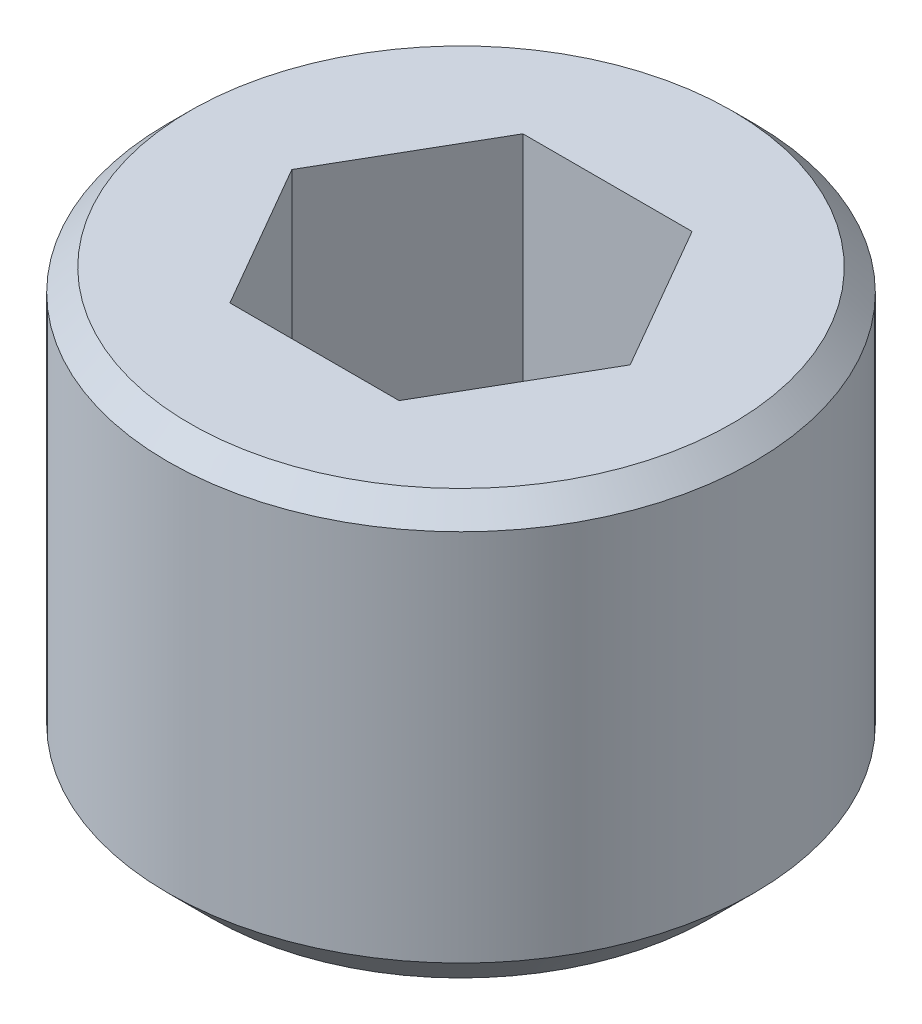
ISO-10303-21;
HEADER;
FILE_DESCRIPTION(('STEP AP214'),'2;1');
FILE_NAME('part.step','',(''),(''),'','','');
FILE_SCHEMA(('AUTOMOTIVE_DESIGN { 1 0 10303 214 1 1 1 1 }'));
ENDSEC;
DATA;
#1=APPLICATION_CONTEXT('core data for automotive mechanical design processes');
#2=APPLICATION_PROTOCOL_DEFINITION('international standard','automotive_design',2000,#1);
#3=PRODUCT_CONTEXT('',#1,'mechanical');
#4=PRODUCT('Part','Part','',(#3));
#5=PRODUCT_RELATED_PRODUCT_CATEGORY('part','',(#4));
#6=PRODUCT_DEFINITION_FORMATION('','',#4);
#7=PRODUCT_DEFINITION_CONTEXT('part definition',#1,'design');
#8=PRODUCT_DEFINITION('design','',#6,#7);
#9=PRODUCT_DEFINITION_SHAPE('','',#8);
#10=(LENGTH_UNIT() NAMED_UNIT(*) SI_UNIT(.MILLI.,.METRE.));
#11=(NAMED_UNIT(*) PLANE_ANGLE_UNIT() SI_UNIT($,.RADIAN.));
#12=(NAMED_UNIT(*) SI_UNIT($,.STERADIAN.) SOLID_ANGLE_UNIT());
#13=UNCERTAINTY_MEASURE_WITH_UNIT(LENGTH_MEASURE(1.E-05),#10,'distance_accuracy_value','');
#14=(GEOMETRIC_REPRESENTATION_CONTEXT(3) GLOBAL_UNCERTAINTY_ASSIGNED_CONTEXT((#13)) GLOBAL_UNIT_ASSIGNED_CONTEXT((#10,
#11,#12)) REPRESENTATION_CONTEXT('',''));
#15=CARTESIAN_POINT('',(0.,0.,0.));
#16=DIRECTION('',(0.,0.,1.));
#17=DIRECTION('',(1.,0.,0.));
#18=AXIS2_PLACEMENT_3D('',#15,#16,#17);
#19=CARTESIAN_POINT('',(0.,0.,0.));
#20=DIRECTION('',(0.,-1.,0.));
#21=DIRECTION('',(0.,0.,-1.));
#22=AXIS2_PLACEMENT_3D('',#19,#20,#21);
#23=PLANE('',#22);
#24=CARTESIAN_POINT('',(0.,0.,0.));
#25=DIRECTION('',(0.,-1.,0.));
#26=DIRECTION('',(0.,0.,-1.));
#27=AXIS2_PLACEMENT_3D('',#24,#25,#26);
#28=CIRCLE('',#27,1.85);
#29=CARTESIAN_POINT('',(0.,0.,-1.85));
#30=VERTEX_POINT('',#29);
#31=EDGE_CURVE('E42',#30,#30,#28,.F.);
#32=ORIENTED_EDGE('',*,*,#31,.T.);
#33=EDGE_LOOP('',(#32));
#34=FACE_BOUND('',#33,.T.);
#35=DIRECTION('',(-0.5,0.,0.866025403784439));
#36=VECTOR('',#35,1.);
#37=CARTESIAN_POINT('',(-0.577350269189626,0.,-1.));
#38=LINE('',#37,#36);
#39=CARTESIAN_POINT('',(-0.577350269189626,0.,-1.));
#40=VERTEX_POINT('',#39);
#41=CARTESIAN_POINT('',(-1.15470053837925,0.,0.));
#42=VERTEX_POINT('',#41);
#43=EDGE_CURVE('E123',#40,#42,#38,.T.);
#44=ORIENTED_EDGE('',*,*,#43,.F.);
#45=DIRECTION('',(-1.,0.,0.));
#46=VECTOR('',#45,1.);
#47=CARTESIAN_POINT('',(0.577350269189626,0.,-1.));
#48=LINE('',#47,#46);
#49=CARTESIAN_POINT('',(0.577350269189626,0.,-1.));
#50=VERTEX_POINT('',#49);
#51=EDGE_CURVE('E49',#50,#40,#48,.T.);
#52=ORIENTED_EDGE('',*,*,#51,.F.);
#53=DIRECTION('',(-0.5,0.,-0.866025403784438));
#54=VECTOR('',#53,1.);
#55=CARTESIAN_POINT('',(1.15470053837925,0.,0.));
#56=LINE('',#55,#54);
#57=CARTESIAN_POINT('',(1.15470053837925,0.,0.));
#58=VERTEX_POINT('',#57);
#59=EDGE_CURVE('E132',#58,#50,#56,.T.);
#60=ORIENTED_EDGE('',*,*,#59,.F.);
#61=DIRECTION('',(0.5,0.,-0.866025403784439));
#62=VECTOR('',#61,1.);
#63=CARTESIAN_POINT('',(0.577350269189626,0.,1.));
#64=LINE('',#63,#62);
#65=CARTESIAN_POINT('',(0.577350269189626,0.,1.));
#66=VERTEX_POINT('',#65);
#67=EDGE_CURVE('E130',#66,#58,#64,.T.);
#68=ORIENTED_EDGE('',*,*,#67,.F.);
#69=DIRECTION('',(1.,0.,0.));
#70=VECTOR('',#69,1.);
#71=CARTESIAN_POINT('',(-0.577350269189626,0.,1.));
#72=LINE('',#71,#70);
#73=CARTESIAN_POINT('',(-0.577350269189626,0.,1.));
#74=VERTEX_POINT('',#73);
#75=EDGE_CURVE('E97',#74,#66,#72,.T.);
#76=ORIENTED_EDGE('',*,*,#75,.F.);
#77=DIRECTION('',(0.5,0.,0.866025403784439));
#78=VECTOR('',#77,1.);
#79=CARTESIAN_POINT('',(-1.15470053837925,0.,0.));
#80=LINE('',#79,#78);
#81=EDGE_CURVE('E126',#42,#74,#80,.T.);
#82=ORIENTED_EDGE('',*,*,#81,.F.);
#83=EDGE_LOOP('',(#44,#52,#60,#68,#76,#82));
#84=FACE_BOUND('',#83,.T.);
#85=ADVANCED_FACE('F34',(#34,#84),#23,.F.);
#86=CARTESIAN_POINT('',(0.,0.,0.));
#87=DIRECTION('',(0.,1.,0.));
#88=DIRECTION('',(0.,0.,1.));
#89=AXIS2_PLACEMENT_3D('',#86,#87,#88);
#90=CYLINDRICAL_SURFACE('',#89,2.);
#91=CARTESIAN_POINT('',(0.,-0.15,0.));
#92=DIRECTION('',(0.,-1.,0.));
#93=DIRECTION('',(0.,0.,-1.));
#94=AXIS2_PLACEMENT_3D('',#91,#92,#93);
#95=CIRCLE('',#94,2.);
#96=CARTESIAN_POINT('',(0.,-0.15,-2.));
#97=VERTEX_POINT('',#96);
#98=EDGE_CURVE('E11',#97,#97,#95,.T.);
#99=ORIENTED_EDGE('',*,*,#98,.T.);
#100=EDGE_LOOP('',(#99));
#101=FACE_BOUND('',#100,.T.);
#102=CARTESIAN_POINT('',(0.,-2.7,0.));
#103=DIRECTION('',(0.,1.,0.));
#104=DIRECTION('',(0.,0.,1.));
#105=AXIS2_PLACEMENT_3D('',#102,#103,#104);
#106=CIRCLE('',#105,2.);
#107=CARTESIAN_POINT('',(0.,-2.7,2.));
#108=VERTEX_POINT('',#107);
#109=EDGE_CURVE('E136',#108,#108,#106,.T.);
#110=ORIENTED_EDGE('',*,*,#109,.T.);
#111=EDGE_LOOP('',(#110));
#112=FACE_BOUND('',#111,.T.);
#113=ADVANCED_FACE('F160',(#101,#112),#90,.T.);
#114=CARTESIAN_POINT('',(2.,-3.,0.));
#115=DIRECTION('',(0.,1.,0.));
#116=DIRECTION('',(0.,0.,1.));
#117=AXIS2_PLACEMENT_3D('',#114,#115,#116);
#118=PLANE('',#117);
#119=CARTESIAN_POINT('',(0.,-3.,0.));
#120=DIRECTION('',(0.,1.,0.));
#121=DIRECTION('',(0.,0.,1.));
#122=AXIS2_PLACEMENT_3D('',#119,#120,#121);
#123=CIRCLE('',#122,1.7);
#124=CARTESIAN_POINT('',(0.,-3.,1.7));
#125=VERTEX_POINT('',#124);
#126=EDGE_CURVE('E144',#125,#125,#123,.F.);
#127=ORIENTED_EDGE('',*,*,#126,.T.);
#128=EDGE_LOOP('',(#127));
#129=FACE_BOUND('',#128,.T.);
#130=ADVANCED_FACE('F165',(#129),#118,.F.);
#131=CARTESIAN_POINT('',(0.577350269189626,-2.,-1.));
#132=DIRECTION('',(0.,0.,-1.));
#133=DIRECTION('',(-1.,0.,0.));
#134=AXIS2_PLACEMENT_3D('',#131,#132,#133);
#135=PLANE('',#134);
#136=ORIENTED_EDGE('',*,*,#51,.T.);
#137=DIRECTION('',(0.,1.,0.));
#138=VECTOR('',#137,1.);
#139=CARTESIAN_POINT('',(-0.577350269189626,-2.,-1.));
#140=LINE('',#139,#138);
#141=CARTESIAN_POINT('',(-0.577350269189626,-2.,-1.));
#142=VERTEX_POINT('',#141);
#143=EDGE_CURVE('E79',#142,#40,#140,.T.);
#144=ORIENTED_EDGE('',*,*,#143,.F.);
#145=DIRECTION('',(-1.,0.,0.));
#146=VECTOR('',#145,1.);
#147=CARTESIAN_POINT('',(0.577350269189626,-2.,-1.));
#148=LINE('',#147,#146);
#149=CARTESIAN_POINT('',(0.577350269189626,-2.,-1.));
#150=VERTEX_POINT('',#149);
#151=EDGE_CURVE('E134',#150,#142,#148,.T.);
#152=ORIENTED_EDGE('',*,*,#151,.F.);
#153=DIRECTION('',(0.,1.,0.));
#154=VECTOR('',#153,1.);
#155=CARTESIAN_POINT('',(0.577350269189626,-2.,-1.));
#156=LINE('',#155,#154);
#157=EDGE_CURVE('E57',#150,#50,#156,.T.);
#158=ORIENTED_EDGE('',*,*,#157,.T.);
#159=EDGE_LOOP('',(#136,#144,#152,#158));
#160=FACE_BOUND('',#159,.T.);
#161=ADVANCED_FACE('F171',(#160),#135,.F.);
#162=CARTESIAN_POINT('',(1.15470053837925,-2.,0.));
#163=DIRECTION('',(0.866025403784439,0.,-0.5));
#164=DIRECTION('',(-0.5,0.,-0.866025403784439));
#165=AXIS2_PLACEMENT_3D('',#162,#163,#164);
#166=PLANE('',#165);
#167=ORIENTED_EDGE('',*,*,#59,.T.);
#168=ORIENTED_EDGE('',*,*,#157,.F.);
#169=DIRECTION('',(-0.5,0.,-0.866025403784438));
#170=VECTOR('',#169,1.);
#171=CARTESIAN_POINT('',(1.15470053837925,-2.,0.));
#172=LINE('',#171,#170);
#173=CARTESIAN_POINT('',(1.15470053837925,-2.,0.));
#174=VERTEX_POINT('',#173);
#175=EDGE_CURVE('E109',#174,#150,#172,.T.);
#176=ORIENTED_EDGE('',*,*,#175,.F.);
#177=DIRECTION('',(0.,1.,0.));
#178=VECTOR('',#177,1.);
#179=CARTESIAN_POINT('',(1.15470053837925,-2.,0.));
#180=LINE('',#179,#178);
#181=EDGE_CURVE('E101',#174,#58,#180,.T.);
#182=ORIENTED_EDGE('',*,*,#181,.T.);
#183=EDGE_LOOP('',(#167,#168,#176,#182));
#184=FACE_BOUND('',#183,.T.);
#185=ADVANCED_FACE('F175',(#184),#166,.F.);
#186=CARTESIAN_POINT('',(0.577350269189626,-2.,1.));
#187=DIRECTION('',(0.866025403784439,0.,0.5));
#188=DIRECTION('',(0.5,0.,-0.866025403784439));
#189=AXIS2_PLACEMENT_3D('',#186,#187,#188);
#190=PLANE('',#189);
#191=ORIENTED_EDGE('',*,*,#67,.T.);
#192=ORIENTED_EDGE('',*,*,#181,.F.);
#193=DIRECTION('',(0.5,0.,-0.866025403784439));
#194=VECTOR('',#193,1.);
#195=CARTESIAN_POINT('',(0.577350269189626,-2.,1.));
#196=LINE('',#195,#194);
#197=CARTESIAN_POINT('',(0.577350269189626,-2.,1.));
#198=VERTEX_POINT('',#197);
#199=EDGE_CURVE('E105',#198,#174,#196,.T.);
#200=ORIENTED_EDGE('',*,*,#199,.F.);
#201=DIRECTION('',(0.,1.,0.));
#202=VECTOR('',#201,1.);
#203=CARTESIAN_POINT('',(0.577350269189626,-2.,1.));
#204=LINE('',#203,#202);
#205=EDGE_CURVE('E90',#198,#66,#204,.T.);
#206=ORIENTED_EDGE('',*,*,#205,.T.);
#207=EDGE_LOOP('',(#191,#192,#200,#206));
#208=FACE_BOUND('',#207,.T.);
#209=ADVANCED_FACE('F106',(#208),#190,.F.);
#210=CARTESIAN_POINT('',(-0.577350269189626,-2.,1.));
#211=DIRECTION('',(0.,0.,1.));
#212=DIRECTION('',(1.,0.,0.));
#213=AXIS2_PLACEMENT_3D('',#210,#211,#212);
#214=PLANE('',#213);
#215=ORIENTED_EDGE('',*,*,#75,.T.);
#216=ORIENTED_EDGE('',*,*,#205,.F.);
#217=DIRECTION('',(1.,0.,0.));
#218=VECTOR('',#217,1.);
#219=CARTESIAN_POINT('',(-0.577350269189626,-2.,1.));
#220=LINE('',#219,#218);
#221=CARTESIAN_POINT('',(-0.577350269189626,-2.,1.));
#222=VERTEX_POINT('',#221);
#223=EDGE_CURVE('E94',#222,#198,#220,.T.);
#224=ORIENTED_EDGE('',*,*,#223,.F.);
#225=DIRECTION('',(0.,1.,0.));
#226=VECTOR('',#225,1.);
#227=CARTESIAN_POINT('',(-0.577350269189626,-2.,1.));
#228=LINE('',#227,#226);
#229=EDGE_CURVE('E102',#222,#74,#228,.T.);
#230=ORIENTED_EDGE('',*,*,#229,.T.);
#231=EDGE_LOOP('',(#215,#216,#224,#230));
#232=FACE_BOUND('',#231,.T.);
#233=ADVANCED_FACE('F92',(#232),#214,.F.);
#234=CARTESIAN_POINT('',(-1.15470053837925,-2.,0.));
#235=DIRECTION('',(-0.866025403784439,0.,0.5));
#236=DIRECTION('',(0.5,0.,0.866025403784439));
#237=AXIS2_PLACEMENT_3D('',#234,#235,#236);
#238=PLANE('',#237);
#239=ORIENTED_EDGE('',*,*,#81,.T.);
#240=ORIENTED_EDGE('',*,*,#229,.F.);
#241=DIRECTION('',(0.5,0.,0.866025403784439));
#242=VECTOR('',#241,1.);
#243=CARTESIAN_POINT('',(-1.15470053837925,-2.,0.));
#244=LINE('',#243,#242);
#245=CARTESIAN_POINT('',(-1.15470053837925,-2.,0.));
#246=VERTEX_POINT('',#245);
#247=EDGE_CURVE('E115',#246,#222,#244,.T.);
#248=ORIENTED_EDGE('',*,*,#247,.F.);
#249=DIRECTION('',(0.,1.,0.));
#250=VECTOR('',#249,1.);
#251=CARTESIAN_POINT('',(-1.15470053837925,-2.,0.));
#252=LINE('',#251,#250);
#253=EDGE_CURVE('E139',#246,#42,#252,.T.);
#254=ORIENTED_EDGE('',*,*,#253,.T.);
#255=EDGE_LOOP('',(#239,#240,#248,#254));
#256=FACE_BOUND('',#255,.T.);
#257=ADVANCED_FACE('F179',(#256),#238,.F.);
#258=CARTESIAN_POINT('',(-0.577350269189626,-2.,-1.));
#259=DIRECTION('',(-0.866025403784439,0.,-0.5));
#260=DIRECTION('',(-0.5,0.,0.866025403784439));
#261=AXIS2_PLACEMENT_3D('',#258,#259,#260);
#262=PLANE('',#261);
#263=ORIENTED_EDGE('',*,*,#43,.T.);
#264=ORIENTED_EDGE('',*,*,#253,.F.);
#265=DIRECTION('',(-0.5,0.,0.866025403784439));
#266=VECTOR('',#265,1.);
#267=CARTESIAN_POINT('',(-0.577350269189626,-2.,-1.));
#268=LINE('',#267,#266);
#269=EDGE_CURVE('E117',#142,#246,#268,.T.);
#270=ORIENTED_EDGE('',*,*,#269,.F.);
#271=ORIENTED_EDGE('',*,*,#143,.T.);
#272=EDGE_LOOP('',(#263,#264,#270,#271));
#273=FACE_BOUND('',#272,.T.);
#274=ADVANCED_FACE('F176',(#273),#262,.F.);
#275=CARTESIAN_POINT('',(-0.577350269189626,-2.,-1.));
#276=DIRECTION('',(0.,1.,0.));
#277=DIRECTION('',(0.,0.,1.));
#278=AXIS2_PLACEMENT_3D('',#275,#276,#277);
#279=PLANE('',#278);
#280=ORIENTED_EDGE('',*,*,#151,.T.);
#281=ORIENTED_EDGE('',*,*,#269,.T.);
#282=ORIENTED_EDGE('',*,*,#247,.T.);
#283=ORIENTED_EDGE('',*,*,#223,.T.);
#284=ORIENTED_EDGE('',*,*,#199,.T.);
#285=ORIENTED_EDGE('',*,*,#175,.T.);
#286=EDGE_LOOP('',(#280,#281,#282,#283,#284,#285));
#287=FACE_BOUND('',#286,.T.);
#288=ADVANCED_FACE('F112',(#287),#279,.T.);
#289=CARTESIAN_POINT('',(0.,-2.7,0.));
#290=DIRECTION('',(0.,1.,0.));
#291=DIRECTION('',(0.,0.,1.));
#292=AXIS2_PLACEMENT_3D('',#289,#290,#291);
#293=CONICAL_SURFACE('',#292,2.,0.785398163397449);
#294=ORIENTED_EDGE('',*,*,#126,.F.);
#295=EDGE_LOOP('',(#294));
#296=FACE_BOUND('',#295,.T.);
#297=ORIENTED_EDGE('',*,*,#109,.F.);
#298=EDGE_LOOP('',(#297));
#299=FACE_BOUND('',#298,.T.);
#300=ADVANCED_FACE('F152',(#296,#299),#293,.T.);
#301=CARTESIAN_POINT('',(0.,0.,0.));
#302=DIRECTION('',(0.,-1.,0.));
#303=DIRECTION('',(0.,0.,-1.));
#304=AXIS2_PLACEMENT_3D('',#301,#302,#303);
#305=CONICAL_SURFACE('',#304,1.85,0.785398163397448);
#306=ORIENTED_EDGE('',*,*,#98,.F.);
#307=EDGE_LOOP('',(#306));
#308=FACE_BOUND('',#307,.T.);
#309=ORIENTED_EDGE('',*,*,#31,.F.);
#310=EDGE_LOOP('',(#309));
#311=FACE_BOUND('',#310,.T.);
#312=ADVANCED_FACE('F36',(#308,#311),#305,.T.);
#313=CLOSED_SHELL('',(#85,#113,#130,#161,#185,#209,#233,#257,#274,#288,#300,#312));
#314=MANIFOLD_SOLID_BREP('B2',#313);
#315=ADVANCED_BREP_SHAPE_REPRESENTATION('',(#18,#314),#14);
#316=SHAPE_DEFINITION_REPRESENTATION(#9,#315);
ENDSEC;
END-ISO-10303-21;
